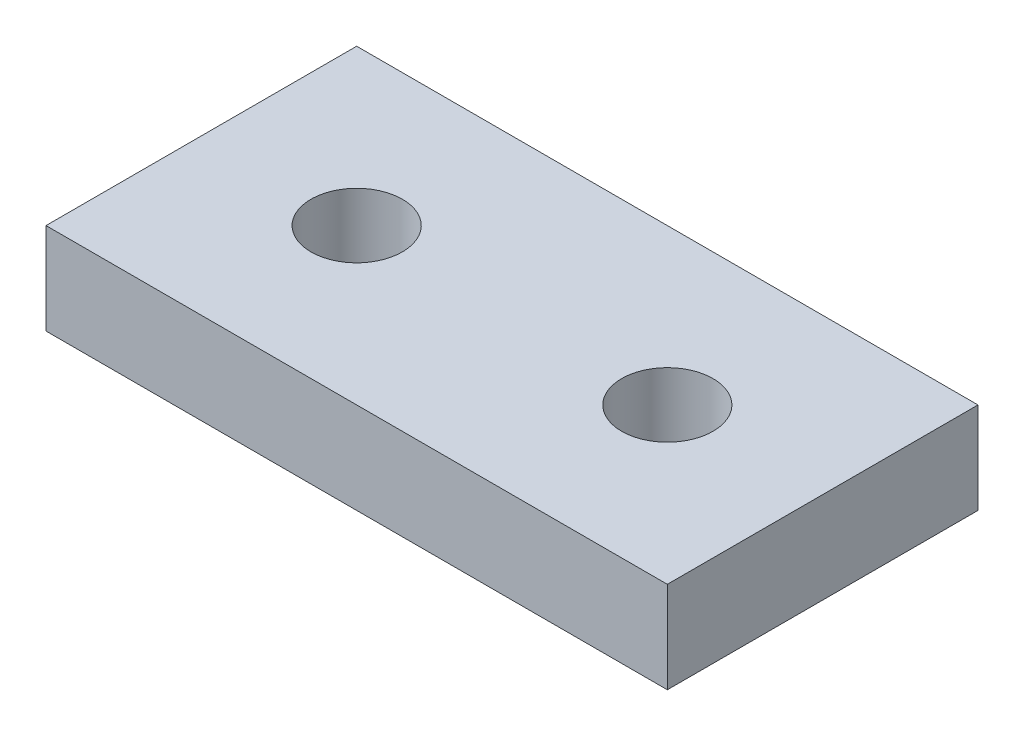
ISO-10303-21;
HEADER;
FILE_DESCRIPTION(('STEP AP214'),'2;1');
FILE_NAME('part.step','',(''),(''),'','','');
FILE_SCHEMA(('AUTOMOTIVE_DESIGN { 1 0 10303 214 1 1 1 1 }'));
ENDSEC;
DATA;
#1=APPLICATION_CONTEXT('core data for automotive mechanical design processes');
#2=APPLICATION_PROTOCOL_DEFINITION('international standard','automotive_design',2000,#1);
#3=PRODUCT_CONTEXT('',#1,'mechanical');
#4=PRODUCT('Part','Part','',(#3));
#5=PRODUCT_RELATED_PRODUCT_CATEGORY('part','',(#4));
#6=PRODUCT_DEFINITION_FORMATION('','',#4);
#7=PRODUCT_DEFINITION_CONTEXT('part definition',#1,'design');
#8=PRODUCT_DEFINITION('design','',#6,#7);
#9=PRODUCT_DEFINITION_SHAPE('','',#8);
#10=(LENGTH_UNIT() NAMED_UNIT(*) SI_UNIT(.MILLI.,.METRE.));
#11=(NAMED_UNIT(*) PLANE_ANGLE_UNIT() SI_UNIT($,.RADIAN.));
#12=(NAMED_UNIT(*) SI_UNIT($,.STERADIAN.) SOLID_ANGLE_UNIT());
#13=UNCERTAINTY_MEASURE_WITH_UNIT(LENGTH_MEASURE(1.E-05),#10,'distance_accuracy_value','');
#14=(GEOMETRIC_REPRESENTATION_CONTEXT(3) GLOBAL_UNCERTAINTY_ASSIGNED_CONTEXT((#13)) GLOBAL_UNIT_ASSIGNED_CONTEXT((#10,
#11,#12)) REPRESENTATION_CONTEXT('',''));
#15=CARTESIAN_POINT('',(0.,0.,0.));
#16=DIRECTION('',(0.,0.,1.));
#17=DIRECTION('',(1.,0.,0.));
#18=AXIS2_PLACEMENT_3D('',#15,#16,#17);
#19=CARTESIAN_POINT('',(0.,5.,0.));
#20=DIRECTION('',(0.,1.,0.));
#21=DIRECTION('',(0.,0.,1.));
#22=AXIS2_PLACEMENT_3D('',#19,#20,#21);
#23=PLANE('',#22);
#24=CARTESIAN_POINT('',(8.5,5.,8.5));
#25=DIRECTION('',(0.,1.,0.));
#26=DIRECTION('',(0.,0.,1.));
#27=AXIS2_PLACEMENT_3D('',#24,#25,#26);
#28=CIRCLE('',#27,2.5);
#29=CARTESIAN_POINT('',(8.5,5.,11.));
#30=VERTEX_POINT('',#29);
#31=EDGE_CURVE('E106',#30,#30,#28,.T.);
#32=ORIENTED_EDGE('',*,*,#31,.F.);
#33=EDGE_LOOP('',(#32));
#34=FACE_BOUND('',#33,.T.);
#35=DIRECTION('',(0.,0.,1.));
#36=VECTOR('',#35,1.);
#37=CARTESIAN_POINT('',(0.,5.,0.));
#38=LINE('',#37,#36);
#39=CARTESIAN_POINT('',(0.,5.,0.));
#40=VERTEX_POINT('',#39);
#41=CARTESIAN_POINT('',(0.,5.,17.));
#42=VERTEX_POINT('',#41);
#43=EDGE_CURVE('E91',#40,#42,#38,.T.);
#44=ORIENTED_EDGE('',*,*,#43,.T.);
#45=DIRECTION('',(1.,0.,0.));
#46=VECTOR('',#45,1.);
#47=CARTESIAN_POINT('',(0.,5.,17.));
#48=LINE('',#47,#46);
#49=CARTESIAN_POINT('',(34.,5.,17.));
#50=VERTEX_POINT('',#49);
#51=EDGE_CURVE('E86',#42,#50,#48,.T.);
#52=ORIENTED_EDGE('',*,*,#51,.T.);
#53=DIRECTION('',(0.,0.,-1.));
#54=VECTOR('',#53,1.);
#55=CARTESIAN_POINT('',(34.,5.,0.));
#56=LINE('',#55,#54);
#57=CARTESIAN_POINT('',(34.,5.,0.));
#58=VERTEX_POINT('',#57);
#59=EDGE_CURVE('E89',#50,#58,#56,.T.);
#60=ORIENTED_EDGE('',*,*,#59,.T.);
#61=DIRECTION('',(-1.,0.,0.));
#62=VECTOR('',#61,1.);
#63=CARTESIAN_POINT('',(0.,5.,0.));
#64=LINE('',#63,#62);
#65=EDGE_CURVE('E56',#58,#40,#64,.T.);
#66=ORIENTED_EDGE('',*,*,#65,.T.);
#67=EDGE_LOOP('',(#44,#52,#60,#66));
#68=FACE_BOUND('',#67,.T.);
#69=CARTESIAN_POINT('',(25.5,5.,8.5));
#70=DIRECTION('',(0.,1.,0.));
#71=DIRECTION('',(0.,0.,1.));
#72=AXIS2_PLACEMENT_3D('',#69,#70,#71);
#73=CIRCLE('',#72,2.5);
#74=CARTESIAN_POINT('',(25.5,5.,11.));
#75=VERTEX_POINT('',#74);
#76=EDGE_CURVE('E121',#75,#75,#73,.T.);
#77=ORIENTED_EDGE('',*,*,#76,.F.);
#78=EDGE_LOOP('',(#77));
#79=FACE_BOUND('',#78,.T.);
#80=ADVANCED_FACE('F39',(#34,#68,#79),#23,.T.);
#81=CARTESIAN_POINT('',(0.,0.,0.));
#82=DIRECTION('',(0.,1.,0.));
#83=DIRECTION('',(0.,0.,1.));
#84=AXIS2_PLACEMENT_3D('',#81,#82,#83);
#85=PLANE('',#84);
#86=DIRECTION('',(0.,0.,1.));
#87=VECTOR('',#86,1.);
#88=CARTESIAN_POINT('',(0.,0.,0.));
#89=LINE('',#88,#87);
#90=CARTESIAN_POINT('',(0.,0.,0.));
#91=VERTEX_POINT('',#90);
#92=CARTESIAN_POINT('',(0.,0.,17.));
#93=VERTEX_POINT('',#92);
#94=EDGE_CURVE('E103',#91,#93,#89,.T.);
#95=ORIENTED_EDGE('',*,*,#94,.F.);
#96=DIRECTION('',(-1.,0.,0.));
#97=VECTOR('',#96,1.);
#98=CARTESIAN_POINT('',(0.,0.,0.));
#99=LINE('',#98,#97);
#100=CARTESIAN_POINT('',(34.,0.,0.));
#101=VERTEX_POINT('',#100);
#102=EDGE_CURVE('E79',#101,#91,#99,.T.);
#103=ORIENTED_EDGE('',*,*,#102,.F.);
#104=DIRECTION('',(0.,0.,-1.));
#105=VECTOR('',#104,1.);
#106=CARTESIAN_POINT('',(34.,0.,0.));
#107=LINE('',#106,#105);
#108=CARTESIAN_POINT('',(34.,0.,17.));
#109=VERTEX_POINT('',#108);
#110=EDGE_CURVE('E73',#109,#101,#107,.T.);
#111=ORIENTED_EDGE('',*,*,#110,.F.);
#112=DIRECTION('',(1.,0.,0.));
#113=VECTOR('',#112,1.);
#114=CARTESIAN_POINT('',(0.,0.,17.));
#115=LINE('',#114,#113);
#116=EDGE_CURVE('E95',#93,#109,#115,.T.);
#117=ORIENTED_EDGE('',*,*,#116,.F.);
#118=EDGE_LOOP('',(#95,#103,#111,#117));
#119=FACE_BOUND('',#118,.T.);
#120=CARTESIAN_POINT('',(8.5,0.,8.5));
#121=DIRECTION('',(0.,1.,0.));
#122=DIRECTION('',(0.,0.,1.));
#123=AXIS2_PLACEMENT_3D('',#120,#121,#122);
#124=CIRCLE('',#123,2.5);
#125=CARTESIAN_POINT('',(8.5,0.,11.));
#126=VERTEX_POINT('',#125);
#127=EDGE_CURVE('E118',#126,#126,#124,.T.);
#128=ORIENTED_EDGE('',*,*,#127,.T.);
#129=EDGE_LOOP('',(#128));
#130=FACE_BOUND('',#129,.T.);
#131=CARTESIAN_POINT('',(25.5,0.,8.5));
#132=DIRECTION('',(0.,1.,0.));
#133=DIRECTION('',(0.,0.,1.));
#134=AXIS2_PLACEMENT_3D('',#131,#132,#133);
#135=CIRCLE('',#134,2.5);
#136=CARTESIAN_POINT('',(25.5,0.,11.));
#137=VERTEX_POINT('',#136);
#138=EDGE_CURVE('E124',#137,#137,#135,.T.);
#139=ORIENTED_EDGE('',*,*,#138,.T.);
#140=EDGE_LOOP('',(#139));
#141=FACE_BOUND('',#140,.T.);
#142=ADVANCED_FACE('F114',(#119,#130,#141),#85,.F.);
#143=CARTESIAN_POINT('',(0.,5.,0.));
#144=DIRECTION('',(1.,0.,0.));
#145=DIRECTION('',(0.,0.,-1.));
#146=AXIS2_PLACEMENT_3D('',#143,#144,#145);
#147=PLANE('',#146);
#148=ORIENTED_EDGE('',*,*,#94,.T.);
#149=DIRECTION('',(0.,-1.,0.));
#150=VECTOR('',#149,1.);
#151=CARTESIAN_POINT('',(0.,5.,17.));
#152=LINE('',#151,#150);
#153=EDGE_CURVE('E11',#42,#93,#152,.T.);
#154=ORIENTED_EDGE('',*,*,#153,.F.);
#155=ORIENTED_EDGE('',*,*,#43,.F.);
#156=DIRECTION('',(0.,-1.,0.));
#157=VECTOR('',#156,1.);
#158=CARTESIAN_POINT('',(0.,5.,0.));
#159=LINE('',#158,#157);
#160=EDGE_CURVE('E99',#40,#91,#159,.T.);
#161=ORIENTED_EDGE('',*,*,#160,.T.);
#162=EDGE_LOOP('',(#148,#154,#155,#161));
#163=FACE_BOUND('',#162,.T.);
#164=ADVANCED_FACE('F41',(#163),#147,.F.);
#165=CARTESIAN_POINT('',(0.,5.,17.));
#166=DIRECTION('',(0.,0.,-1.));
#167=DIRECTION('',(-1.,0.,0.));
#168=AXIS2_PLACEMENT_3D('',#165,#166,#167);
#169=PLANE('',#168);
#170=ORIENTED_EDGE('',*,*,#116,.T.);
#171=DIRECTION('',(0.,-1.,0.));
#172=VECTOR('',#171,1.);
#173=CARTESIAN_POINT('',(34.,5.,17.));
#174=LINE('',#173,#172);
#175=EDGE_CURVE('E48',#50,#109,#174,.T.);
#176=ORIENTED_EDGE('',*,*,#175,.F.);
#177=ORIENTED_EDGE('',*,*,#51,.F.);
#178=ORIENTED_EDGE('',*,*,#153,.T.);
#179=EDGE_LOOP('',(#170,#176,#177,#178));
#180=FACE_BOUND('',#179,.T.);
#181=ADVANCED_FACE('F94',(#180),#169,.F.);
#182=CARTESIAN_POINT('',(34.,5.,0.));
#183=DIRECTION('',(-1.,0.,0.));
#184=DIRECTION('',(0.,0.,1.));
#185=AXIS2_PLACEMENT_3D('',#182,#183,#184);
#186=PLANE('',#185);
#187=ORIENTED_EDGE('',*,*,#110,.T.);
#188=DIRECTION('',(0.,-1.,0.));
#189=VECTOR('',#188,1.);
#190=CARTESIAN_POINT('',(34.,5.,0.));
#191=LINE('',#190,#189);
#192=EDGE_CURVE('E96',#58,#101,#191,.T.);
#193=ORIENTED_EDGE('',*,*,#192,.F.);
#194=ORIENTED_EDGE('',*,*,#59,.F.);
#195=ORIENTED_EDGE('',*,*,#175,.T.);
#196=EDGE_LOOP('',(#187,#193,#194,#195));
#197=FACE_BOUND('',#196,.T.);
#198=ADVANCED_FACE('F97',(#197),#186,.F.);
#199=CARTESIAN_POINT('',(0.,5.,0.));
#200=DIRECTION('',(0.,0.,1.));
#201=DIRECTION('',(1.,0.,0.));
#202=AXIS2_PLACEMENT_3D('',#199,#200,#201);
#203=PLANE('',#202);
#204=ORIENTED_EDGE('',*,*,#102,.T.);
#205=ORIENTED_EDGE('',*,*,#160,.F.);
#206=ORIENTED_EDGE('',*,*,#65,.F.);
#207=ORIENTED_EDGE('',*,*,#192,.T.);
#208=EDGE_LOOP('',(#204,#205,#206,#207));
#209=FACE_BOUND('',#208,.T.);
#210=ADVANCED_FACE('F111',(#209),#203,.F.);
#211=CARTESIAN_POINT('',(8.5,5.,8.5));
#212=DIRECTION('',(0.,-1.,0.));
#213=DIRECTION('',(0.,0.,-1.));
#214=AXIS2_PLACEMENT_3D('',#211,#212,#213);
#215=CYLINDRICAL_SURFACE('',#214,2.5);
#216=ORIENTED_EDGE('',*,*,#31,.T.);
#217=EDGE_LOOP('',(#216));
#218=FACE_BOUND('',#217,.T.);
#219=ORIENTED_EDGE('',*,*,#127,.F.);
#220=EDGE_LOOP('',(#219));
#221=FACE_BOUND('',#220,.T.);
#222=ADVANCED_FACE('F141',(#218,#221),#215,.F.);
#223=CARTESIAN_POINT('',(25.5,5.,8.5));
#224=DIRECTION('',(0.,-1.,0.));
#225=DIRECTION('',(0.,0.,-1.));
#226=AXIS2_PLACEMENT_3D('',#223,#224,#225);
#227=CYLINDRICAL_SURFACE('',#226,2.5);
#228=ORIENTED_EDGE('',*,*,#76,.T.);
#229=EDGE_LOOP('',(#228));
#230=FACE_BOUND('',#229,.T.);
#231=ORIENTED_EDGE('',*,*,#138,.F.);
#232=EDGE_LOOP('',(#231));
#233=FACE_BOUND('',#232,.T.);
#234=ADVANCED_FACE('F130',(#230,#233),#227,.F.);
#235=CLOSED_SHELL('',(#80,#142,#164,#181,#198,#210,#222,#234));
#236=MANIFOLD_SOLID_BREP('B2',#235);
#237=ADVANCED_BREP_SHAPE_REPRESENTATION('',(#18,#236),#14);
#238=SHAPE_DEFINITION_REPRESENTATION(#9,#237);
ENDSEC;
END-ISO-10303-21;
